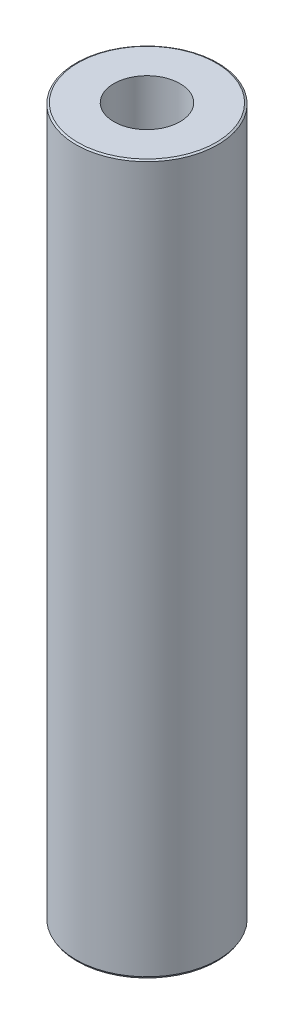
ISO-10303-21;
HEADER;
FILE_DESCRIPTION(('STEP AP214'),'2;1');
FILE_NAME('part.step','',(''),(''),'','','');
FILE_SCHEMA(('AUTOMOTIVE_DESIGN { 1 0 10303 214 1 1 1 1 }'));
ENDSEC;
DATA;
#1=APPLICATION_CONTEXT('core data for automotive mechanical design processes');
#2=APPLICATION_PROTOCOL_DEFINITION('international standard','automotive_design',2000,#1);
#3=PRODUCT_CONTEXT('',#1,'mechanical');
#4=PRODUCT('Part','Part','',(#3));
#5=PRODUCT_RELATED_PRODUCT_CATEGORY('part','',(#4));
#6=PRODUCT_DEFINITION_FORMATION('','',#4);
#7=PRODUCT_DEFINITION_CONTEXT('part definition',#1,'design');
#8=PRODUCT_DEFINITION('design','',#6,#7);
#9=PRODUCT_DEFINITION_SHAPE('','',#8);
#10=(LENGTH_UNIT() NAMED_UNIT(*) SI_UNIT(.MILLI.,.METRE.));
#11=(NAMED_UNIT(*) PLANE_ANGLE_UNIT() SI_UNIT($,.RADIAN.));
#12=(NAMED_UNIT(*) SI_UNIT($,.STERADIAN.) SOLID_ANGLE_UNIT());
#13=UNCERTAINTY_MEASURE_WITH_UNIT(LENGTH_MEASURE(1.E-05),#10,'distance_accuracy_value','');
#14=(GEOMETRIC_REPRESENTATION_CONTEXT(3) GLOBAL_UNCERTAINTY_ASSIGNED_CONTEXT((#13)) GLOBAL_UNIT_ASSIGNED_CONTEXT((#10,
#11,#12)) REPRESENTATION_CONTEXT('',''));
#15=CARTESIAN_POINT('',(0.,0.,0.));
#16=DIRECTION('',(0.,0.,1.));
#17=DIRECTION('',(1.,0.,0.));
#18=AXIS2_PLACEMENT_3D('',#15,#16,#17);
#19=CARTESIAN_POINT('',(0.,600.,0.));
#20=DIRECTION('',(0.,-1.,0.));
#21=DIRECTION('',(0.,0.,-1.));
#22=AXIS2_PLACEMENT_3D('',#19,#20,#21);
#23=CYLINDRICAL_SURFACE('',#22,60.);
#24=CARTESIAN_POINT('',(0.,599.112138033735,0.));
#25=DIRECTION('',(0.,1.,0.));
#26=DIRECTION('',(0.,0.,1.));
#27=AXIS2_PLACEMENT_3D('',#24,#25,#26);
#28=CIRCLE('',#27,60.);
#29=CARTESIAN_POINT('',(0.,599.112138033735,60.));
#30=VERTEX_POINT('',#29);
#31=EDGE_CURVE('E50',#30,#30,#28,.F.);
#32=ORIENTED_EDGE('',*,*,#31,.T.);
#33=EDGE_LOOP('',(#32));
#34=FACE_BOUND('',#33,.T.);
#35=CARTESIAN_POINT('',(0.,1.53782203567865,0.));
#36=DIRECTION('',(0.,1.,0.));
#37=DIRECTION('',(0.,0.,1.));
#38=AXIS2_PLACEMENT_3D('',#35,#36,#37);
#39=CIRCLE('',#38,60.);
#40=CARTESIAN_POINT('',(0.,1.53782203567865,60.));
#41=VERTEX_POINT('',#40);
#42=EDGE_CURVE('E51',#41,#41,#39,.T.);
#43=ORIENTED_EDGE('',*,*,#42,.T.);
#44=EDGE_LOOP('',(#43));
#45=FACE_BOUND('',#44,.T.);
#46=ADVANCED_FACE('F39',(#34,#45),#23,.T.);
#47=CARTESIAN_POINT('',(0.,600.,0.));
#48=DIRECTION('',(0.,1.,0.));
#49=DIRECTION('',(0.,0.,1.));
#50=AXIS2_PLACEMENT_3D('',#47,#48,#49);
#51=PLANE('',#50);
#52=CARTESIAN_POINT('',(0.,600.,0.));
#53=DIRECTION('',(0.,1.,0.));
#54=DIRECTION('',(0.,0.,1.));
#55=AXIS2_PLACEMENT_3D('',#52,#53,#54);
#56=CIRCLE('',#55,58.4621779643213);
#57=CARTESIAN_POINT('',(0.,600.,58.4621779643213));
#58=VERTEX_POINT('',#57);
#59=EDGE_CURVE('E54',#58,#58,#56,.T.);
#60=ORIENTED_EDGE('',*,*,#59,.T.);
#61=EDGE_LOOP('',(#60));
#62=FACE_BOUND('',#61,.T.);
#63=CARTESIAN_POINT('',(0.,600.,0.));
#64=DIRECTION('',(0.,1.,0.));
#65=DIRECTION('',(0.,0.,1.));
#66=AXIS2_PLACEMENT_3D('',#63,#64,#65);
#67=CIRCLE('',#66,28.0030122205677);
#68=CARTESIAN_POINT('',(0.,600.,28.0030122205677));
#69=VERTEX_POINT('',#68);
#70=EDGE_CURVE('E58',#69,#69,#67,.T.);
#71=ORIENTED_EDGE('',*,*,#70,.F.);
#72=EDGE_LOOP('',(#71));
#73=FACE_BOUND('',#72,.T.);
#74=ADVANCED_FACE('F69',(#62,#73),#51,.T.);
#75=CARTESIAN_POINT('',(0.,0.,0.));
#76=DIRECTION('',(0.,1.,0.));
#77=DIRECTION('',(0.,0.,1.));
#78=AXIS2_PLACEMENT_3D('',#75,#76,#77);
#79=PLANE('',#78);
#80=CARTESIAN_POINT('',(0.,0.,0.));
#81=DIRECTION('',(0.,1.,0.));
#82=DIRECTION('',(0.,0.,1.));
#83=AXIS2_PLACEMENT_3D('',#80,#81,#82);
#84=CIRCLE('',#83,59.1121380337352);
#85=CARTESIAN_POINT('',(0.,0.,59.1121380337352));
#86=VERTEX_POINT('',#85);
#87=EDGE_CURVE('E10',#86,#86,#84,.F.);
#88=ORIENTED_EDGE('',*,*,#87,.T.);
#89=EDGE_LOOP('',(#88));
#90=FACE_BOUND('',#89,.T.);
#91=CARTESIAN_POINT('',(0.,0.,0.));
#92=DIRECTION('',(0.,1.,0.));
#93=DIRECTION('',(0.,0.,1.));
#94=AXIS2_PLACEMENT_3D('',#91,#92,#93);
#95=CIRCLE('',#94,28.0030122205677);
#96=CARTESIAN_POINT('',(0.,0.,28.0030122205677));
#97=VERTEX_POINT('',#96);
#98=EDGE_CURVE('E63',#97,#97,#95,.T.);
#99=ORIENTED_EDGE('',*,*,#98,.T.);
#100=EDGE_LOOP('',(#99));
#101=FACE_BOUND('',#100,.T.);
#102=ADVANCED_FACE('F75',(#90,#101),#79,.F.);
#103=CARTESIAN_POINT('',(0.,600.,0.));
#104=DIRECTION('',(0.,-1.,0.));
#105=DIRECTION('',(0.,0.,-1.));
#106=AXIS2_PLACEMENT_3D('',#103,#104,#105);
#107=CYLINDRICAL_SURFACE('',#106,28.0030122205677);
#108=ORIENTED_EDGE('',*,*,#70,.T.);
#109=EDGE_LOOP('',(#108));
#110=FACE_BOUND('',#109,.T.);
#111=ORIENTED_EDGE('',*,*,#98,.F.);
#112=EDGE_LOOP('',(#111));
#113=FACE_BOUND('',#112,.T.);
#114=ADVANCED_FACE('F70',(#110,#113),#107,.F.);
#115=CARTESIAN_POINT('',(0.,600.,0.));
#116=DIRECTION('',(0.,-1.,0.));
#117=DIRECTION('',(0.,0.,-1.));
#118=AXIS2_PLACEMENT_3D('',#115,#116,#117);
#119=CONICAL_SURFACE('',#118,58.4621779643213,1.04719755119657);
#120=ORIENTED_EDGE('',*,*,#31,.F.);
#121=EDGE_LOOP('',(#120));
#122=FACE_BOUND('',#121,.T.);
#123=ORIENTED_EDGE('',*,*,#59,.F.);
#124=EDGE_LOOP('',(#123));
#125=FACE_BOUND('',#124,.T.);
#126=ADVANCED_FACE('F81',(#122,#125),#119,.T.);
#127=CARTESIAN_POINT('',(0.,1.53782203567865,0.));
#128=DIRECTION('',(0.,1.,0.));
#129=DIRECTION('',(0.,0.,1.));
#130=AXIS2_PLACEMENT_3D('',#127,#128,#129);
#131=CONICAL_SURFACE('',#130,60.,0.523598775598286);
#132=ORIENTED_EDGE('',*,*,#87,.F.);
#133=EDGE_LOOP('',(#132));
#134=FACE_BOUND('',#133,.T.);
#135=ORIENTED_EDGE('',*,*,#42,.F.);
#136=EDGE_LOOP('',(#135));
#137=FACE_BOUND('',#136,.T.);
#138=ADVANCED_FACE('F45',(#134,#137),#131,.T.);
#139=CLOSED_SHELL('',(#46,#74,#102,#114,#126,#138));
#140=MANIFOLD_SOLID_BREP('B2',#139);
#141=ADVANCED_BREP_SHAPE_REPRESENTATION('',(#18,#140),#14);
#142=SHAPE_DEFINITION_REPRESENTATION(#9,#141);
ENDSEC;
END-ISO-10303-21;
